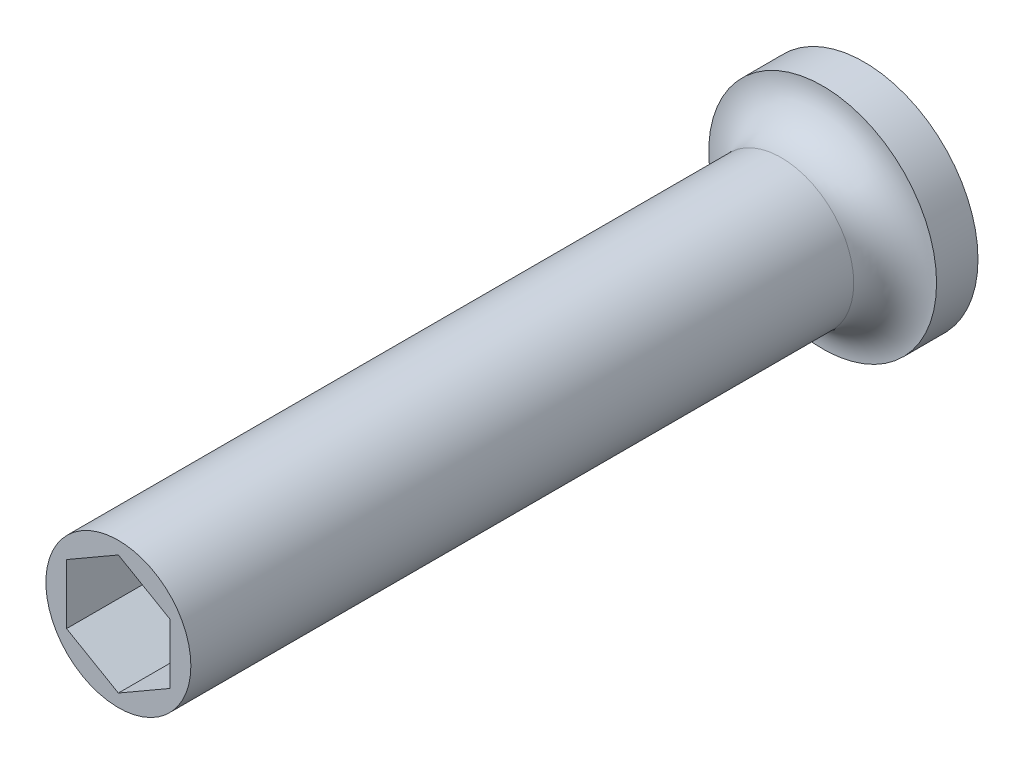
ISO-10303-21;
HEADER;
FILE_DESCRIPTION(('STEP AP214'),'2;1');
FILE_NAME('part.step','',(''),(''),'','','');
FILE_SCHEMA(('AUTOMOTIVE_DESIGN { 1 0 10303 214 1 1 1 1 }'));
ENDSEC;
DATA;
#1=APPLICATION_CONTEXT('core data for automotive mechanical design processes');
#2=APPLICATION_PROTOCOL_DEFINITION('international standard','automotive_design',2000,#1);
#3=PRODUCT_CONTEXT('',#1,'mechanical');
#4=PRODUCT('Part','Part','',(#3));
#5=PRODUCT_RELATED_PRODUCT_CATEGORY('part','',(#4));
#6=PRODUCT_DEFINITION_FORMATION('','',#4);
#7=PRODUCT_DEFINITION_CONTEXT('part definition',#1,'design');
#8=PRODUCT_DEFINITION('design','',#6,#7);
#9=PRODUCT_DEFINITION_SHAPE('','',#8);
#10=(LENGTH_UNIT() NAMED_UNIT(*) SI_UNIT(.MILLI.,.METRE.));
#11=(NAMED_UNIT(*) PLANE_ANGLE_UNIT() SI_UNIT($,.RADIAN.));
#12=(NAMED_UNIT(*) SI_UNIT($,.STERADIAN.) SOLID_ANGLE_UNIT());
#13=UNCERTAINTY_MEASURE_WITH_UNIT(LENGTH_MEASURE(1.E-05),#10,'distance_accuracy_value','');
#14=(GEOMETRIC_REPRESENTATION_CONTEXT(3) GLOBAL_UNCERTAINTY_ASSIGNED_CONTEXT((#13)) GLOBAL_UNIT_ASSIGNED_CONTEXT((#10,
#11,#12)) REPRESENTATION_CONTEXT('',''));
#15=CARTESIAN_POINT('',(0.,0.,0.));
#16=DIRECTION('',(0.,0.,1.));
#17=DIRECTION('',(1.,0.,0.));
#18=AXIS2_PLACEMENT_3D('',#15,#16,#17);
#19=CARTESIAN_POINT('',(0.,0.,-0.01));
#20=DIRECTION('',(0.,0.,1.));
#21=DIRECTION('',(1.,0.,0.));
#22=AXIS2_PLACEMENT_3D('',#19,#20,#21);
#23=CYLINDRICAL_SURFACE('',#22,5.5);
#24=CARTESIAN_POINT('',(0.,0.,3.));
#25=DIRECTION('',(0.,0.,1.));
#26=DIRECTION('',(1.,0.,0.));
#27=AXIS2_PLACEMENT_3D('',#24,#25,#26);
#28=CIRCLE('',#27,5.5);
#29=CARTESIAN_POINT('',(5.5,0.,3.));
#30=VERTEX_POINT('',#29);
#31=EDGE_CURVE('E51',#30,#30,#28,.F.);
#32=ORIENTED_EDGE('',*,*,#31,.T.);
#33=EDGE_LOOP('',(#32));
#34=FACE_BOUND('',#33,.T.);
#35=CARTESIAN_POINT('',(0.,0.,1.));
#36=DIRECTION('',(0.,0.,-1.));
#37=DIRECTION('',(-1.,0.,0.));
#38=AXIS2_PLACEMENT_3D('',#35,#36,#37);
#39=CIRCLE('',#38,5.5);
#40=CARTESIAN_POINT('',(-5.5,0.,1.));
#41=VERTEX_POINT('',#40);
#42=EDGE_CURVE('E224',#41,#41,#39,.T.);
#43=ORIENTED_EDGE('',*,*,#42,.F.);
#44=EDGE_LOOP('',(#43));
#45=FACE_BOUND('',#44,.T.);
#46=ADVANCED_FACE('F47',(#34,#45),#23,.T.);
#47=CARTESIAN_POINT('',(0.,0.,37.));
#48=DIRECTION('',(0.,0.,-1.));
#49=DIRECTION('',(-1.,0.,0.));
#50=AXIS2_PLACEMENT_3D('',#47,#48,#49);
#51=CYLINDRICAL_SURFACE('',#50,3.5);
#52=CARTESIAN_POINT('',(0.,0.,5.));
#53=DIRECTION('',(0.,0.,1.));
#54=DIRECTION('',(1.,0.,0.));
#55=AXIS2_PLACEMENT_3D('',#52,#53,#54);
#56=CIRCLE('',#55,3.5);
#57=CARTESIAN_POINT('',(3.5,0.,5.));
#58=VERTEX_POINT('',#57);
#59=EDGE_CURVE('E214',#58,#58,#56,.T.);
#60=ORIENTED_EDGE('',*,*,#59,.T.);
#61=EDGE_LOOP('',(#60));
#62=FACE_BOUND('',#61,.T.);
#63=CARTESIAN_POINT('',(0.,0.,37.));
#64=DIRECTION('',(0.,0.,1.));
#65=DIRECTION('',(1.,0.,0.));
#66=AXIS2_PLACEMENT_3D('',#63,#64,#65);
#67=CIRCLE('',#66,3.5);
#68=CARTESIAN_POINT('',(3.5,0.,37.));
#69=VERTEX_POINT('',#68);
#70=EDGE_CURVE('E209',#69,#69,#67,.T.);
#71=ORIENTED_EDGE('',*,*,#70,.F.);
#72=EDGE_LOOP('',(#71));
#73=FACE_BOUND('',#72,.T.);
#74=ADVANCED_FACE('F182',(#62,#73),#51,.T.);
#75=CARTESIAN_POINT('',(0.,0.,37.));
#76=DIRECTION('',(0.,0.,1.));
#77=DIRECTION('',(1.,0.,0.));
#78=AXIS2_PLACEMENT_3D('',#75,#76,#77);
#79=PLANE('',#78);
#80=DIRECTION('',(0.,1.,0.));
#81=VECTOR('',#80,1.);
#82=CARTESIAN_POINT('',(2.49999999999995,-1.44337567297404,37.));
#83=LINE('',#82,#81);
#84=CARTESIAN_POINT('',(2.49999999999995,-1.44337567297404,37.));
#85=VERTEX_POINT('',#84);
#86=CARTESIAN_POINT('',(2.49999999999995,1.44337567297403,37.));
#87=VERTEX_POINT('',#86);
#88=EDGE_CURVE('E11',#85,#87,#83,.T.);
#89=ORIENTED_EDGE('',*,*,#88,.F.);
#90=DIRECTION('',(0.866025403784439,0.5,0.));
#91=VECTOR('',#90,1.);
#92=CARTESIAN_POINT('',(0.,-2.88675134594807,37.));
#93=LINE('',#92,#91);
#94=CARTESIAN_POINT('',(0.,-2.88675134594807,37.));
#95=VERTEX_POINT('',#94);
#96=EDGE_CURVE('E133',#95,#85,#93,.T.);
#97=ORIENTED_EDGE('',*,*,#96,.F.);
#98=DIRECTION('',(0.866025403784438,-0.500000000000001,0.));
#99=VECTOR('',#98,1.);
#100=CARTESIAN_POINT('',(-2.49999999999995,-1.44337567297404,37.));
#101=LINE('',#100,#99);
#102=CARTESIAN_POINT('',(-2.49999999999995,-1.44337567297404,37.));
#103=VERTEX_POINT('',#102);
#104=EDGE_CURVE('E111',#103,#95,#101,.T.);
#105=ORIENTED_EDGE('',*,*,#104,.F.);
#106=DIRECTION('',(0.,-1.,0.));
#107=VECTOR('',#106,1.);
#108=CARTESIAN_POINT('',(-2.49999999999995,1.44337567297404,37.));
#109=LINE('',#108,#107);
#110=CARTESIAN_POINT('',(-2.49999999999995,1.44337567297404,37.));
#111=VERTEX_POINT('',#110);
#112=EDGE_CURVE('E123',#111,#103,#109,.T.);
#113=ORIENTED_EDGE('',*,*,#112,.F.);
#114=DIRECTION('',(-0.866025403784439,-0.499999999999999,0.));
#115=VECTOR('',#114,1.);
#116=CARTESIAN_POINT('',(0.,2.88675134594807,37.));
#117=LINE('',#116,#115);
#118=CARTESIAN_POINT('',(0.,2.88675134594807,37.));
#119=VERTEX_POINT('',#118);
#120=EDGE_CURVE('E128',#119,#111,#117,.T.);
#121=ORIENTED_EDGE('',*,*,#120,.F.);
#122=DIRECTION('',(-0.866025403784438,0.500000000000001,0.));
#123=VECTOR('',#122,1.);
#124=CARTESIAN_POINT('',(2.49999999999995,1.44337567297403,37.));
#125=LINE('',#124,#123);
#126=EDGE_CURVE('E58',#87,#119,#125,.T.);
#127=ORIENTED_EDGE('',*,*,#126,.F.);
#128=EDGE_LOOP('',(#89,#97,#105,#113,#121,#127));
#129=FACE_BOUND('',#128,.T.);
#130=ORIENTED_EDGE('',*,*,#70,.T.);
#131=EDGE_LOOP('',(#130));
#132=FACE_BOUND('',#131,.T.);
#133=ADVANCED_FACE('F131',(#129,#132),#79,.T.);
#134=CARTESIAN_POINT('',(0.,0.,5.));
#135=DIRECTION('',(0.,0.,1.));
#136=DIRECTION('',(1.,0.,0.));
#137=AXIS2_PLACEMENT_3D('',#134,#135,#136);
#138=TOROIDAL_SURFACE('',#137,5.5,2.);
#139=ORIENTED_EDGE('',*,*,#31,.F.);
#140=EDGE_LOOP('',(#139));
#141=FACE_BOUND('',#140,.T.);
#142=ORIENTED_EDGE('',*,*,#59,.F.);
#143=EDGE_LOOP('',(#142));
#144=FACE_BOUND('',#143,.T.);
#145=ADVANCED_FACE('F169',(#141,#144),#138,.F.);
#146=CARTESIAN_POINT('',(2.49999999999995,-1.44337567297404,27.));
#147=DIRECTION('',(1.,0.,0.));
#148=DIRECTION('',(0.,0.,-1.));
#149=AXIS2_PLACEMENT_3D('',#146,#147,#148);
#150=PLANE('',#149);
#151=ORIENTED_EDGE('',*,*,#88,.T.);
#152=DIRECTION('',(0.,0.,1.));
#153=VECTOR('',#152,1.);
#154=CARTESIAN_POINT('',(2.49999999999995,1.44337567297403,27.));
#155=LINE('',#154,#153);
#156=CARTESIAN_POINT('',(2.49999999999995,1.44337567297403,27.));
#157=VERTEX_POINT('',#156);
#158=EDGE_CURVE('E94',#157,#87,#155,.T.);
#159=ORIENTED_EDGE('',*,*,#158,.F.);
#160=DIRECTION('',(0.,1.,0.));
#161=VECTOR('',#160,1.);
#162=CARTESIAN_POINT('',(2.49999999999995,-1.44337567297404,27.));
#163=LINE('',#162,#161);
#164=CARTESIAN_POINT('',(2.49999999999995,-1.44337567297404,27.));
#165=VERTEX_POINT('',#164);
#166=EDGE_CURVE('E137',#165,#157,#163,.T.);
#167=ORIENTED_EDGE('',*,*,#166,.F.);
#168=DIRECTION('',(0.,0.,1.));
#169=VECTOR('',#168,1.);
#170=CARTESIAN_POINT('',(2.49999999999995,-1.44337567297404,27.));
#171=LINE('',#170,#169);
#172=EDGE_CURVE('E98',#165,#85,#171,.T.);
#173=ORIENTED_EDGE('',*,*,#172,.T.);
#174=EDGE_LOOP('',(#151,#159,#167,#173));
#175=FACE_BOUND('',#174,.T.);
#176=ADVANCED_FACE('F166',(#175),#150,.F.);
#177=CARTESIAN_POINT('',(0.,-2.88675134594807,27.));
#178=DIRECTION('',(0.5,-0.866025403784439,0.));
#179=DIRECTION('',(0.866025403784439,0.5,0.));
#180=AXIS2_PLACEMENT_3D('',#177,#178,#179);
#181=PLANE('',#180);
#182=ORIENTED_EDGE('',*,*,#96,.T.);
#183=ORIENTED_EDGE('',*,*,#172,.F.);
#184=DIRECTION('',(0.866025403784439,0.5,0.));
#185=VECTOR('',#184,1.);
#186=CARTESIAN_POINT('',(0.,-2.88675134594807,27.));
#187=LINE('',#186,#185);
#188=CARTESIAN_POINT('',(0.,-2.88675134594807,27.));
#189=VERTEX_POINT('',#188);
#190=EDGE_CURVE('E145',#189,#165,#187,.T.);
#191=ORIENTED_EDGE('',*,*,#190,.F.);
#192=DIRECTION('',(0.,0.,1.));
#193=VECTOR('',#192,1.);
#194=CARTESIAN_POINT('',(0.,-2.88675134594807,27.));
#195=LINE('',#194,#193);
#196=EDGE_CURVE('E120',#189,#95,#195,.T.);
#197=ORIENTED_EDGE('',*,*,#196,.T.);
#198=EDGE_LOOP('',(#182,#183,#191,#197));
#199=FACE_BOUND('',#198,.T.);
#200=ADVANCED_FACE('F168',(#199),#181,.F.);
#201=CARTESIAN_POINT('',(-2.49999999999995,-1.44337567297404,27.));
#202=DIRECTION('',(-0.500000000000001,-0.866025403784438,0.));
#203=DIRECTION('',(0.866025403784438,-0.500000000000001,0.));
#204=AXIS2_PLACEMENT_3D('',#201,#202,#203);
#205=PLANE('',#204);
#206=ORIENTED_EDGE('',*,*,#104,.T.);
#207=ORIENTED_EDGE('',*,*,#196,.F.);
#208=DIRECTION('',(0.866025403784438,-0.500000000000001,0.));
#209=VECTOR('',#208,1.);
#210=CARTESIAN_POINT('',(-2.49999999999995,-1.44337567297404,27.));
#211=LINE('',#210,#209);
#212=CARTESIAN_POINT('',(-2.49999999999995,-1.44337567297404,27.));
#213=VERTEX_POINT('',#212);
#214=EDGE_CURVE('E114',#213,#189,#211,.T.);
#215=ORIENTED_EDGE('',*,*,#214,.F.);
#216=DIRECTION('',(0.,0.,1.));
#217=VECTOR('',#216,1.);
#218=CARTESIAN_POINT('',(-2.49999999999995,-1.44337567297404,27.));
#219=LINE('',#218,#217);
#220=EDGE_CURVE('E107',#213,#103,#219,.T.);
#221=ORIENTED_EDGE('',*,*,#220,.T.);
#222=EDGE_LOOP('',(#206,#207,#215,#221));
#223=FACE_BOUND('',#222,.T.);
#224=ADVANCED_FACE('F109',(#223),#205,.F.);
#225=CARTESIAN_POINT('',(-2.49999999999995,1.44337567297404,27.));
#226=DIRECTION('',(-1.,0.,0.));
#227=DIRECTION('',(0.,0.,1.));
#228=AXIS2_PLACEMENT_3D('',#225,#226,#227);
#229=PLANE('',#228);
#230=ORIENTED_EDGE('',*,*,#112,.T.);
#231=ORIENTED_EDGE('',*,*,#220,.F.);
#232=DIRECTION('',(0.,-1.,0.));
#233=VECTOR('',#232,1.);
#234=CARTESIAN_POINT('',(-2.49999999999995,1.44337567297404,27.));
#235=LINE('',#234,#233);
#236=CARTESIAN_POINT('',(-2.49999999999995,1.44337567297404,27.));
#237=VERTEX_POINT('',#236);
#238=EDGE_CURVE('E151',#237,#213,#235,.T.);
#239=ORIENTED_EDGE('',*,*,#238,.F.);
#240=DIRECTION('',(0.,0.,1.));
#241=VECTOR('',#240,1.);
#242=CARTESIAN_POINT('',(-2.49999999999995,1.44337567297404,27.));
#243=LINE('',#242,#241);
#244=EDGE_CURVE('E119',#237,#111,#243,.T.);
#245=ORIENTED_EDGE('',*,*,#244,.T.);
#246=EDGE_LOOP('',(#230,#231,#239,#245));
#247=FACE_BOUND('',#246,.T.);
#248=ADVANCED_FACE('F124',(#247),#229,.F.);
#249=CARTESIAN_POINT('',(0.,2.88675134594807,27.));
#250=DIRECTION('',(-0.499999999999999,0.866025403784439,0.));
#251=DIRECTION('',(-0.866025403784439,-0.499999999999999,0.));
#252=AXIS2_PLACEMENT_3D('',#249,#250,#251);
#253=PLANE('',#252);
#254=ORIENTED_EDGE('',*,*,#120,.T.);
#255=ORIENTED_EDGE('',*,*,#244,.F.);
#256=DIRECTION('',(-0.866025403784439,-0.499999999999999,0.));
#257=VECTOR('',#256,1.);
#258=CARTESIAN_POINT('',(0.,2.88675134594807,27.));
#259=LINE('',#258,#257);
#260=CARTESIAN_POINT('',(0.,2.88675134594807,27.));
#261=VERTEX_POINT('',#260);
#262=EDGE_CURVE('E154',#261,#237,#259,.T.);
#263=ORIENTED_EDGE('',*,*,#262,.F.);
#264=DIRECTION('',(0.,0.,1.));
#265=VECTOR('',#264,1.);
#266=CARTESIAN_POINT('',(0.,2.88675134594807,27.));
#267=LINE('',#266,#265);
#268=EDGE_CURVE('E67',#261,#119,#267,.T.);
#269=ORIENTED_EDGE('',*,*,#268,.T.);
#270=EDGE_LOOP('',(#254,#255,#263,#269));
#271=FACE_BOUND('',#270,.T.);
#272=ADVANCED_FACE('F200',(#271),#253,.F.);
#273=CARTESIAN_POINT('',(2.49999999999995,1.44337567297403,27.));
#274=DIRECTION('',(0.500000000000001,0.866025403784438,0.));
#275=DIRECTION('',(-0.866025403784438,0.500000000000001,0.));
#276=AXIS2_PLACEMENT_3D('',#273,#274,#275);
#277=PLANE('',#276);
#278=ORIENTED_EDGE('',*,*,#126,.T.);
#279=ORIENTED_EDGE('',*,*,#268,.F.);
#280=DIRECTION('',(-0.866025403784438,0.500000000000001,0.));
#281=VECTOR('',#280,1.);
#282=CARTESIAN_POINT('',(2.49999999999995,1.44337567297403,27.));
#283=LINE('',#282,#281);
#284=EDGE_CURVE('E158',#157,#261,#283,.T.);
#285=ORIENTED_EDGE('',*,*,#284,.F.);
#286=ORIENTED_EDGE('',*,*,#158,.T.);
#287=EDGE_LOOP('',(#278,#279,#285,#286));
#288=FACE_BOUND('',#287,.T.);
#289=ADVANCED_FACE('F194',(#288),#277,.F.);
#290=CARTESIAN_POINT('',(-136.5,0.,27.));
#291=DIRECTION('',(0.,0.,1.));
#292=DIRECTION('',(1.,0.,0.));
#293=AXIS2_PLACEMENT_3D('',#290,#291,#292);
#294=PLANE('',#293);
#295=ORIENTED_EDGE('',*,*,#166,.T.);
#296=ORIENTED_EDGE('',*,*,#284,.T.);
#297=ORIENTED_EDGE('',*,*,#262,.T.);
#298=ORIENTED_EDGE('',*,*,#238,.T.);
#299=ORIENTED_EDGE('',*,*,#214,.T.);
#300=ORIENTED_EDGE('',*,*,#190,.T.);
#301=EDGE_LOOP('',(#295,#296,#297,#298,#299,#300));
#302=FACE_BOUND('',#301,.T.);
#303=ADVANCED_FACE('F164',(#302),#294,.T.);
#304=CARTESIAN_POINT('',(0.,0.,1.));
#305=DIRECTION('',(0.,0.,-1.));
#306=DIRECTION('',(-1.,0.,0.));
#307=AXIS2_PLACEMENT_3D('',#304,#305,#306);
#308=PLANE('',#307);
#309=CARTESIAN_POINT('',(0.,0.,1.));
#310=DIRECTION('',(0.,0.,-1.));
#311=DIRECTION('',(-1.,0.,0.));
#312=AXIS2_PLACEMENT_3D('',#309,#310,#311);
#313=CIRCLE('',#312,4.);
#314=CARTESIAN_POINT('',(-4.,0.,1.));
#315=VERTEX_POINT('',#314);
#316=EDGE_CURVE('E228',#315,#315,#313,.T.);
#317=ORIENTED_EDGE('',*,*,#316,.F.);
#318=EDGE_LOOP('',(#317));
#319=FACE_BOUND('',#318,.T.);
#320=ORIENTED_EDGE('',*,*,#42,.T.);
#321=EDGE_LOOP('',(#320));
#322=FACE_BOUND('',#321,.T.);
#323=ADVANCED_FACE('F193',(#319,#322),#308,.T.);
#324=CARTESIAN_POINT('',(0.,0.,1.));
#325=DIRECTION('',(0.,0.,-1.));
#326=DIRECTION('',(-1.,0.,0.));
#327=AXIS2_PLACEMENT_3D('',#324,#325,#326);
#328=CYLINDRICAL_SURFACE('',#327,4.);
#329=ORIENTED_EDGE('',*,*,#316,.T.);
#330=EDGE_LOOP('',(#329));
#331=FACE_BOUND('',#330,.T.);
#332=CARTESIAN_POINT('',(0.,0.,0.));
#333=DIRECTION('',(0.,0.,-1.));
#334=DIRECTION('',(-1.,0.,0.));
#335=AXIS2_PLACEMENT_3D('',#332,#333,#334);
#336=CIRCLE('',#335,4.);
#337=CARTESIAN_POINT('',(-4.,0.,0.));
#338=VERTEX_POINT('',#337);
#339=EDGE_CURVE('E229',#338,#338,#336,.T.);
#340=ORIENTED_EDGE('',*,*,#339,.F.);
#341=EDGE_LOOP('',(#340));
#342=FACE_BOUND('',#341,.T.);
#343=ADVANCED_FACE('F237',(#331,#342),#328,.T.);
#344=CARTESIAN_POINT('',(0.,0.,0.));
#345=DIRECTION('',(0.,0.,1.));
#346=DIRECTION('',(1.,0.,0.));
#347=AXIS2_PLACEMENT_3D('',#344,#345,#346);
#348=PLANE('',#347);
#349=ORIENTED_EDGE('',*,*,#339,.T.);
#350=EDGE_LOOP('',(#349));
#351=FACE_BOUND('',#350,.T.);
#352=ADVANCED_FACE('F49',(#351),#348,.F.);
#353=CLOSED_SHELL('',(#46,#74,#133,#145,#176,#200,#224,#248,#272,#289,#303,#323,#343,#352));
#354=MANIFOLD_SOLID_BREP('B2',#353);
#355=ADVANCED_BREP_SHAPE_REPRESENTATION('',(#18,#354),#14);
#356=SHAPE_DEFINITION_REPRESENTATION(#9,#355);
ENDSEC;
END-ISO-10303-21;
